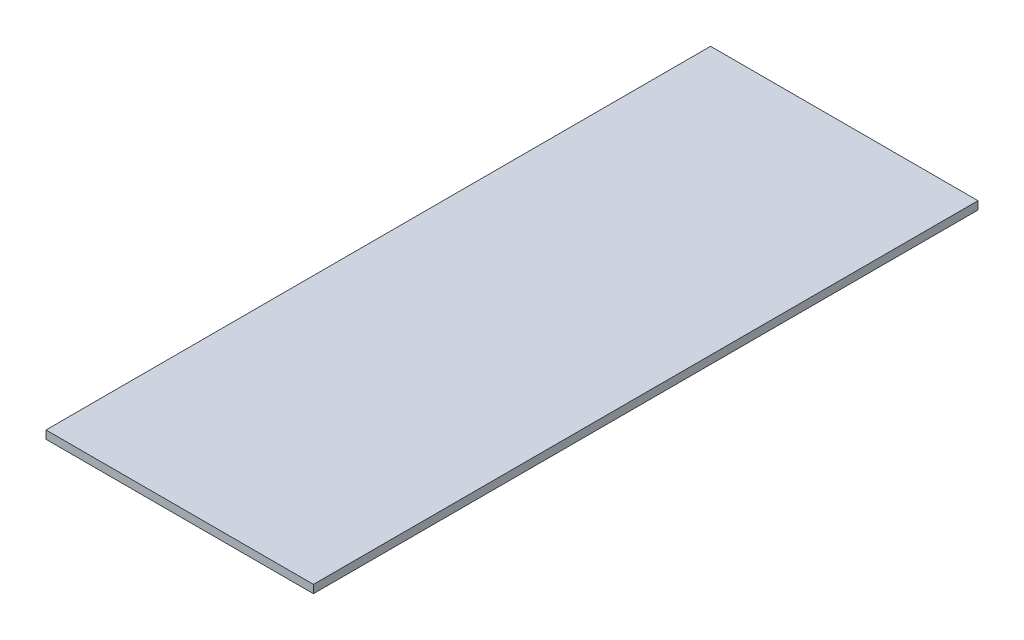
ISO-10303-21;
HEADER;
FILE_DESCRIPTION(('STEP AP214'),'2;1');
FILE_NAME('part.step','',(''),(''),'','','');
FILE_SCHEMA(('AUTOMOTIVE_DESIGN { 1 0 10303 214 1 1 1 1 }'));
ENDSEC;
DATA;
#1=APPLICATION_CONTEXT('core data for automotive mechanical design processes');
#2=APPLICATION_PROTOCOL_DEFINITION('international standard','automotive_design',2000,#1);
#3=PRODUCT_CONTEXT('',#1,'mechanical');
#4=PRODUCT('Part','Part','',(#3));
#5=PRODUCT_RELATED_PRODUCT_CATEGORY('part','',(#4));
#6=PRODUCT_DEFINITION_FORMATION('','',#4);
#7=PRODUCT_DEFINITION_CONTEXT('part definition',#1,'design');
#8=PRODUCT_DEFINITION('design','',#6,#7);
#9=PRODUCT_DEFINITION_SHAPE('','',#8);
#10=(LENGTH_UNIT() NAMED_UNIT(*) SI_UNIT(.MILLI.,.METRE.));
#11=(NAMED_UNIT(*) PLANE_ANGLE_UNIT() SI_UNIT($,.RADIAN.));
#12=(NAMED_UNIT(*) SI_UNIT($,.STERADIAN.) SOLID_ANGLE_UNIT());
#13=UNCERTAINTY_MEASURE_WITH_UNIT(LENGTH_MEASURE(1.E-05),#10,'distance_accuracy_value','');
#14=(GEOMETRIC_REPRESENTATION_CONTEXT(3) GLOBAL_UNCERTAINTY_ASSIGNED_CONTEXT((#13)) GLOBAL_UNIT_ASSIGNED_CONTEXT((#10,
#11,#12)) REPRESENTATION_CONTEXT('',''));
#15=CARTESIAN_POINT('',(0.,0.,0.));
#16=DIRECTION('',(0.,0.,1.));
#17=DIRECTION('',(1.,0.,0.));
#18=AXIS2_PLACEMENT_3D('',#15,#16,#17);
#19=CARTESIAN_POINT('',(-33.,2.,82.));
#20=DIRECTION('',(0.,0.,-1.));
#21=DIRECTION('',(-1.,0.,0.));
#22=AXIS2_PLACEMENT_3D('',#19,#20,#21);
#23=PLANE('',#22);
#24=DIRECTION('',(1.,0.,0.));
#25=VECTOR('',#24,1.);
#26=CARTESIAN_POINT('',(-33.,0.,82.));
#27=LINE('',#26,#25);
#28=CARTESIAN_POINT('',(-33.,0.,82.));
#29=VERTEX_POINT('',#28);
#30=CARTESIAN_POINT('',(33.,0.,82.));
#31=VERTEX_POINT('',#30);
#32=EDGE_CURVE('E100',#29,#31,#27,.T.);
#33=ORIENTED_EDGE('',*,*,#32,.T.);
#34=DIRECTION('',(0.,-1.,0.));
#35=VECTOR('',#34,1.);
#36=CARTESIAN_POINT('',(33.,2.,82.));
#37=LINE('',#36,#35);
#38=CARTESIAN_POINT('',(33.,2.,82.));
#39=VERTEX_POINT('',#38);
#40=EDGE_CURVE('E11',#39,#31,#37,.T.);
#41=ORIENTED_EDGE('',*,*,#40,.F.);
#42=DIRECTION('',(1.,0.,0.));
#43=VECTOR('',#42,1.);
#44=CARTESIAN_POINT('',(-33.,2.,82.));
#45=LINE('',#44,#43);
#46=CARTESIAN_POINT('',(-33.,2.,82.));
#47=VERTEX_POINT('',#46);
#48=EDGE_CURVE('E88',#47,#39,#45,.T.);
#49=ORIENTED_EDGE('',*,*,#48,.F.);
#50=DIRECTION('',(0.,-1.,0.));
#51=VECTOR('',#50,1.);
#52=CARTESIAN_POINT('',(-33.,2.,82.));
#53=LINE('',#52,#51);
#54=EDGE_CURVE('E96',#47,#29,#53,.T.);
#55=ORIENTED_EDGE('',*,*,#54,.T.);
#56=EDGE_LOOP('',(#33,#41,#49,#55));
#57=FACE_BOUND('',#56,.T.);
#58=ADVANCED_FACE('F37',(#57),#23,.F.);
#59=CARTESIAN_POINT('',(33.,2.,82.));
#60=DIRECTION('',(-1.,0.,0.));
#61=DIRECTION('',(0.,0.,1.));
#62=AXIS2_PLACEMENT_3D('',#59,#60,#61);
#63=PLANE('',#62);
#64=DIRECTION('',(0.,0.,-1.));
#65=VECTOR('',#64,1.);
#66=CARTESIAN_POINT('',(33.,0.,82.));
#67=LINE('',#66,#65);
#68=CARTESIAN_POINT('',(33.,0.,-82.));
#69=VERTEX_POINT('',#68);
#70=EDGE_CURVE('E92',#31,#69,#67,.T.);
#71=ORIENTED_EDGE('',*,*,#70,.T.);
#72=DIRECTION('',(0.,-1.,0.));
#73=VECTOR('',#72,1.);
#74=CARTESIAN_POINT('',(33.,2.,-82.));
#75=LINE('',#74,#73);
#76=CARTESIAN_POINT('',(33.,2.,-82.));
#77=VERTEX_POINT('',#76);
#78=EDGE_CURVE('E45',#77,#69,#75,.T.);
#79=ORIENTED_EDGE('',*,*,#78,.F.);
#80=DIRECTION('',(0.,0.,-1.));
#81=VECTOR('',#80,1.);
#82=CARTESIAN_POINT('',(33.,2.,82.));
#83=LINE('',#82,#81);
#84=EDGE_CURVE('E83',#39,#77,#83,.T.);
#85=ORIENTED_EDGE('',*,*,#84,.F.);
#86=ORIENTED_EDGE('',*,*,#40,.T.);
#87=EDGE_LOOP('',(#71,#79,#85,#86));
#88=FACE_BOUND('',#87,.T.);
#89=ADVANCED_FACE('F91',(#88),#63,.F.);
#90=CARTESIAN_POINT('',(-33.,2.,-82.));
#91=DIRECTION('',(0.,0.,1.));
#92=DIRECTION('',(1.,0.,0.));
#93=AXIS2_PLACEMENT_3D('',#90,#91,#92);
#94=PLANE('',#93);
#95=DIRECTION('',(-1.,0.,0.));
#96=VECTOR('',#95,1.);
#97=CARTESIAN_POINT('',(-33.,0.,-82.));
#98=LINE('',#97,#96);
#99=CARTESIAN_POINT('',(-33.,0.,-82.));
#100=VERTEX_POINT('',#99);
#101=EDGE_CURVE('E70',#69,#100,#98,.T.);
#102=ORIENTED_EDGE('',*,*,#101,.T.);
#103=DIRECTION('',(0.,-1.,0.));
#104=VECTOR('',#103,1.);
#105=CARTESIAN_POINT('',(-33.,2.,-82.));
#106=LINE('',#105,#104);
#107=CARTESIAN_POINT('',(-33.,2.,-82.));
#108=VERTEX_POINT('',#107);
#109=EDGE_CURVE('E93',#108,#100,#106,.T.);
#110=ORIENTED_EDGE('',*,*,#109,.F.);
#111=DIRECTION('',(-1.,0.,0.));
#112=VECTOR('',#111,1.);
#113=CARTESIAN_POINT('',(-33.,2.,-82.));
#114=LINE('',#113,#112);
#115=EDGE_CURVE('E86',#77,#108,#114,.T.);
#116=ORIENTED_EDGE('',*,*,#115,.F.);
#117=ORIENTED_EDGE('',*,*,#78,.T.);
#118=EDGE_LOOP('',(#102,#110,#116,#117));
#119=FACE_BOUND('',#118,.T.);
#120=ADVANCED_FACE('F94',(#119),#94,.F.);
#121=CARTESIAN_POINT('',(-33.,2.,82.));
#122=DIRECTION('',(1.,0.,0.));
#123=DIRECTION('',(0.,0.,-1.));
#124=AXIS2_PLACEMENT_3D('',#121,#122,#123);
#125=PLANE('',#124);
#126=DIRECTION('',(0.,0.,1.));
#127=VECTOR('',#126,1.);
#128=CARTESIAN_POINT('',(-33.,0.,82.));
#129=LINE('',#128,#127);
#130=EDGE_CURVE('E76',#100,#29,#129,.T.);
#131=ORIENTED_EDGE('',*,*,#130,.T.);
#132=ORIENTED_EDGE('',*,*,#54,.F.);
#133=DIRECTION('',(0.,0.,1.));
#134=VECTOR('',#133,1.);
#135=CARTESIAN_POINT('',(-33.,2.,82.));
#136=LINE('',#135,#134);
#137=EDGE_CURVE('E53',#108,#47,#136,.T.);
#138=ORIENTED_EDGE('',*,*,#137,.F.);
#139=ORIENTED_EDGE('',*,*,#109,.T.);
#140=EDGE_LOOP('',(#131,#132,#138,#139));
#141=FACE_BOUND('',#140,.T.);
#142=ADVANCED_FACE('F107',(#141),#125,.F.);
#143=CARTESIAN_POINT('',(0.,2.,0.));
#144=DIRECTION('',(0.,1.,0.));
#145=DIRECTION('',(0.,0.,1.));
#146=AXIS2_PLACEMENT_3D('',#143,#144,#145);
#147=PLANE('',#146);
#148=ORIENTED_EDGE('',*,*,#48,.T.);
#149=ORIENTED_EDGE('',*,*,#84,.T.);
#150=ORIENTED_EDGE('',*,*,#115,.T.);
#151=ORIENTED_EDGE('',*,*,#137,.T.);
#152=EDGE_LOOP('',(#148,#149,#150,#151));
#153=FACE_BOUND('',#152,.T.);
#154=ADVANCED_FACE('F84',(#153),#147,.T.);
#155=CARTESIAN_POINT('',(0.,0.,0.));
#156=DIRECTION('',(0.,1.,0.));
#157=DIRECTION('',(0.,0.,1.));
#158=AXIS2_PLACEMENT_3D('',#155,#156,#157);
#159=PLANE('',#158);
#160=ORIENTED_EDGE('',*,*,#32,.F.);
#161=ORIENTED_EDGE('',*,*,#130,.F.);
#162=ORIENTED_EDGE('',*,*,#101,.F.);
#163=ORIENTED_EDGE('',*,*,#70,.F.);
#164=EDGE_LOOP('',(#160,#161,#162,#163));
#165=FACE_BOUND('',#164,.T.);
#166=ADVANCED_FACE('F110',(#165),#159,.F.);
#167=CLOSED_SHELL('',(#58,#89,#120,#142,#154,#166));
#168=MANIFOLD_SOLID_BREP('B2',#167);
#169=ADVANCED_BREP_SHAPE_REPRESENTATION('',(#18,#168),#14);
#170=SHAPE_DEFINITION_REPRESENTATION(#9,#169);
ENDSEC;
END-ISO-10303-21;
